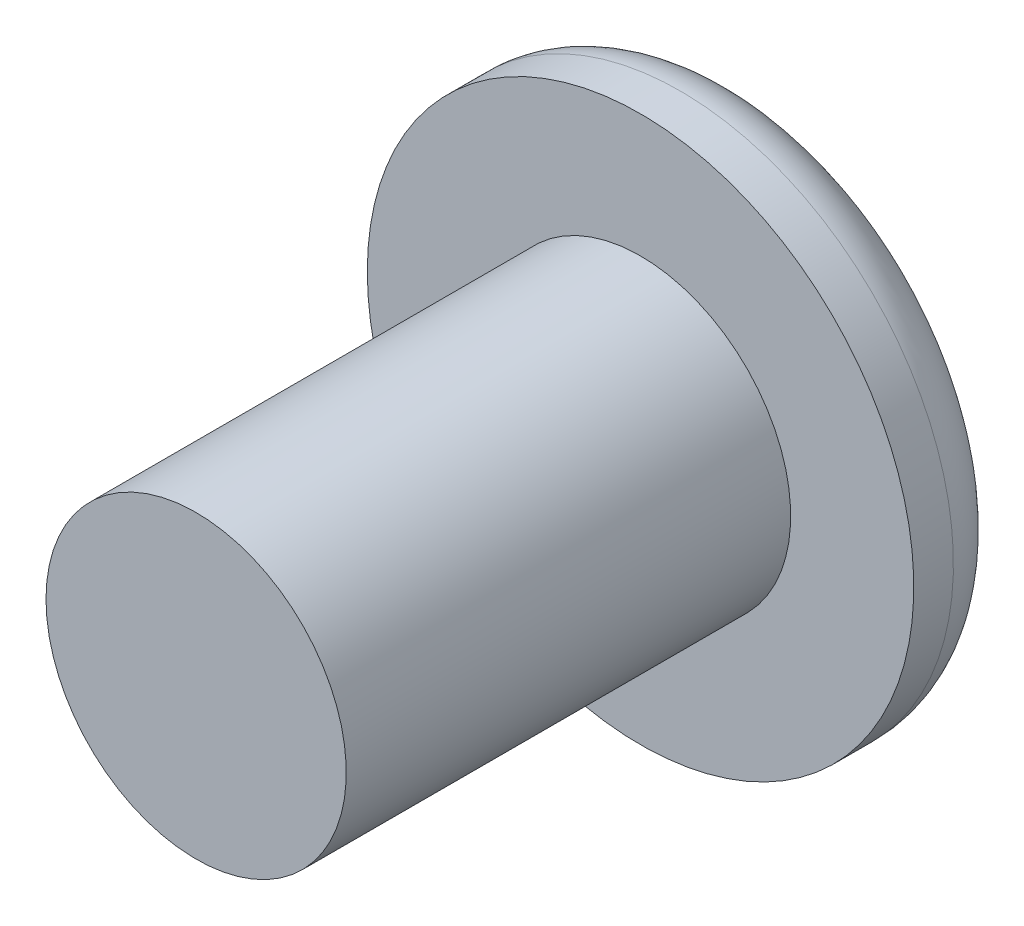
ISO-10303-21;
HEADER;
FILE_DESCRIPTION(('STEP AP214'),'2;1');
FILE_NAME('part.step','',(''),(''),'','','');
FILE_SCHEMA(('AUTOMOTIVE_DESIGN { 1 0 10303 214 1 1 1 1 }'));
ENDSEC;
DATA;
#1=APPLICATION_CONTEXT('core data for automotive mechanical design processes');
#2=APPLICATION_PROTOCOL_DEFINITION('international standard','automotive_design',2000,#1);
#3=PRODUCT_CONTEXT('',#1,'mechanical');
#4=PRODUCT('Part','Part','',(#3));
#5=PRODUCT_RELATED_PRODUCT_CATEGORY('part','',(#4));
#6=PRODUCT_DEFINITION_FORMATION('','',#4);
#7=PRODUCT_DEFINITION_CONTEXT('part definition',#1,'design');
#8=PRODUCT_DEFINITION('design','',#6,#7);
#9=PRODUCT_DEFINITION_SHAPE('','',#8);
#10=(LENGTH_UNIT() NAMED_UNIT(*) SI_UNIT(.MILLI.,.METRE.));
#11=(NAMED_UNIT(*) PLANE_ANGLE_UNIT() SI_UNIT($,.RADIAN.));
#12=(NAMED_UNIT(*) SI_UNIT($,.STERADIAN.) SOLID_ANGLE_UNIT());
#13=UNCERTAINTY_MEASURE_WITH_UNIT(LENGTH_MEASURE(1.E-05),#10,'distance_accuracy_value','');
#14=(GEOMETRIC_REPRESENTATION_CONTEXT(3) GLOBAL_UNCERTAINTY_ASSIGNED_CONTEXT((#13)) GLOBAL_UNIT_ASSIGNED_CONTEXT((#10,
#11,#12)) REPRESENTATION_CONTEXT('',''));
#15=CARTESIAN_POINT('',(0.,0.,0.));
#16=DIRECTION('',(0.,0.,1.));
#17=DIRECTION('',(1.,0.,0.));
#18=AXIS2_PLACEMENT_3D('',#15,#16,#17);
#19=CARTESIAN_POINT('',(-1.,-1.594453362781,-4.53));
#20=DIRECTION('',(-0.984807753012213,0.,0.173648177666902));
#21=DIRECTION('',(0.,1.,0.));
#22=AXIS2_PLACEMENT_3D('',#19,#20,#21);
#23=PLANE('',#22);
#24=DIRECTION('',(0.171087869746004,0.171087869746004,0.970287525247825));
#25=VECTOR('',#24,1.);
#26=CARTESIAN_POINT('',(-1.,-0.3030384493976,-4.53));
#27=LINE('',#26,#25);
#28=CARTESIAN_POINT('',(-1.,-0.3030384493976,-4.53));
#29=VERTEX_POINT('',#28);
#30=CARTESIAN_POINT('',(-0.8589384154332,-0.1619768648308,-3.73));
#31=VERTEX_POINT('',#30);
#32=EDGE_CURVE('E11',#29,#31,#27,.T.);
#33=ORIENTED_EDGE('',*,*,#32,.F.);
#34=DIRECTION('',(0.,1.,0.));
#35=VECTOR('',#34,1.);
#36=CARTESIAN_POINT('',(-1.,-0.3030384493976,-4.53));
#37=LINE('',#36,#35);
#38=CARTESIAN_POINT('',(-1.,0.3030384493976,-4.53));
#39=VERTEX_POINT('',#38);
#40=EDGE_CURVE('E304',#29,#39,#37,.T.);
#41=ORIENTED_EDGE('',*,*,#40,.T.);
#42=DIRECTION('',(0.171087869746004,-0.171087869746004,0.970287525247825));
#43=VECTOR('',#42,1.);
#44=CARTESIAN_POINT('',(-1.,0.3030384493976,-4.53));
#45=LINE('',#44,#43);
#46=CARTESIAN_POINT('',(-0.8589384154332,0.1619768648308,-3.73));
#47=VERTEX_POINT('',#46);
#48=EDGE_CURVE('E404',#39,#47,#45,.T.);
#49=ORIENTED_EDGE('',*,*,#48,.T.);
#50=DIRECTION('',(0.,1.,0.));
#51=VECTOR('',#50,1.);
#52=CARTESIAN_POINT('',(-0.8589384154332,-0.1619768648308,-3.73));
#53=LINE('',#52,#51);
#54=EDGE_CURVE('E263',#31,#47,#53,.T.);
#55=ORIENTED_EDGE('',*,*,#54,.F.);
#56=EDGE_LOOP('',(#33,#41,#49,#55));
#57=FACE_BOUND('',#56,.T.);
#58=ADVANCED_FACE('F16',(#57),#23,.F.);
#59=CARTESIAN_POINT('',(-1.838179807416,-1.338179807416,-10.435308));
#60=DIRECTION('',(0.171087869746005,0.171087869746004,0.970287525247825));
#61=DIRECTION('',(-0.984807753012214,0.,0.173648177666898));
#62=AXIS2_PLACEMENT_3D('',#59,#60,#61);
#63=CYLINDRICAL_SURFACE('',#62,0.2);
#64=CARTESIAN_POINT('',(-0.655853093055913,-0.155853093055913,-3.73));
#65=DIRECTION('',(0.,0.,-1.));
#66=DIRECTION('',(-0.707106781186547,-0.707106781186548,0.));
#67=AXIS2_PLACEMENT_3D('',#64,#65,#66);
#68=ELLIPSE('',#67,0.206124468052825,0.2);
#69=CARTESIAN_POINT('',(-0.6619768648308,-0.3589384154332,-3.73));
#70=VERTEX_POINT('',#69);
#71=EDGE_CURVE('E364',#70,#31,#68,.T.);
#72=ORIENTED_EDGE('',*,*,#71,.F.);
#73=DIRECTION('',(0.171087869746004,0.171087869746004,0.970287525247825));
#74=VECTOR('',#73,1.);
#75=CARTESIAN_POINT('',(-0.8030384493976,-0.5,-4.53));
#76=LINE('',#75,#74);
#77=CARTESIAN_POINT('',(-0.8030384493976,-0.5,-4.53));
#78=VERTEX_POINT('',#77);
#79=EDGE_CURVE('E27',#78,#70,#76,.T.);
#80=ORIENTED_EDGE('',*,*,#79,.F.);
#81=CARTESIAN_POINT('',(-0.796914677622658,-0.296914677622658,-4.53));
#82=DIRECTION('',(0.,0.,1.));
#83=DIRECTION('',(-0.707106781186547,-0.707106781186548,0.));
#84=AXIS2_PLACEMENT_3D('',#81,#82,#83);
#85=ELLIPSE('',#84,0.206124468052825,0.2);
#86=EDGE_CURVE('E308',#29,#78,#85,.T.);
#87=ORIENTED_EDGE('',*,*,#86,.F.);
#88=ORIENTED_EDGE('',*,*,#32,.T.);
#89=EDGE_LOOP('',(#72,#80,#87,#88));
#90=FACE_BOUND('',#89,.T.);
#91=ADVANCED_FACE('F602',(#90),#63,.F.);
#92=CARTESIAN_POINT('',(0.5944533627813,-0.5,-4.53));
#93=DIRECTION('',(0.,-0.984807753012213,0.173648177666902));
#94=DIRECTION('',(-1.,0.,0.));
#95=AXIS2_PLACEMENT_3D('',#92,#93,#94);
#96=PLANE('',#95);
#97=DIRECTION('',(-0.171087869746004,-0.171087869746004,-0.970287525247825));
#98=VECTOR('',#97,1.);
#99=CARTESIAN_POINT('',(-0.5558999660357,-0.3589384154332,-3.73));
#100=LINE('',#99,#98);
#101=CARTESIAN_POINT('',(-0.5558999660357,-0.3589384154332,-3.73));
#102=VERTEX_POINT('',#101);
#103=CARTESIAN_POINT('',(-0.6969615506024,-0.5,-4.53));
#104=VERTEX_POINT('',#103);
#105=EDGE_CURVE('E357',#102,#104,#100,.T.);
#106=ORIENTED_EDGE('',*,*,#105,.T.);
#107=DIRECTION('',(-1.,0.,0.));
#108=VECTOR('',#107,1.);
#109=CARTESIAN_POINT('',(-0.6969615506024,-0.5,-4.53));
#110=LINE('',#109,#108);
#111=EDGE_CURVE('E316',#104,#78,#110,.T.);
#112=ORIENTED_EDGE('',*,*,#111,.T.);
#113=ORIENTED_EDGE('',*,*,#79,.T.);
#114=DIRECTION('',(-1.,0.,0.));
#115=VECTOR('',#114,1.);
#116=CARTESIAN_POINT('',(-0.5558999660357,-0.3589384154332,-3.73));
#117=LINE('',#116,#115);
#118=EDGE_CURVE('E393',#102,#70,#117,.T.);
#119=ORIENTED_EDGE('',*,*,#118,.F.);
#120=EDGE_LOOP('',(#106,#112,#113,#119));
#121=FACE_BOUND('',#120,.T.);
#122=ADVANCED_FACE('F608',(#121),#96,.F.);
#123=CARTESIAN_POINT('',(1.136941030026,1.136941030026,5.905308));
#124=DIRECTION('',(-0.171087869746004,-0.171087869746005,-0.970287525247825));
#125=DIRECTION('',(0.,0.984807753012214,-0.173648177666898));
#126=AXIS2_PLACEMENT_3D('',#123,#124,#125);
#127=CYLINDRICAL_SURFACE('',#126,0.2);
#128=CARTESIAN_POINT('',(-0.703085322376535,-0.703085322376535,-4.53));
#129=DIRECTION('',(0.,0.,-1.));
#130=DIRECTION('',(0.707106781186548,0.707106781186547,0.));
#131=AXIS2_PLACEMENT_3D('',#128,#129,#130);
#132=ELLIPSE('',#131,0.206124468052825,0.2);
#133=CARTESIAN_POINT('',(-0.5,-0.6969615506024,-4.53));
#134=VERTEX_POINT('',#133);
#135=EDGE_CURVE('E320',#104,#134,#132,.T.);
#136=ORIENTED_EDGE('',*,*,#135,.F.);
#137=ORIENTED_EDGE('',*,*,#105,.F.);
#138=CARTESIAN_POINT('',(-0.56202373780979,-0.56202373780979,-3.73));
#139=DIRECTION('',(0.,0.,1.));
#140=DIRECTION('',(0.707106781186548,0.707106781186547,0.));
#141=AXIS2_PLACEMENT_3D('',#138,#139,#140);
#142=ELLIPSE('',#141,0.206124468052825,0.2);
#143=CARTESIAN_POINT('',(-0.3589384154332,-0.5558999660357,-3.73));
#144=VERTEX_POINT('',#143);
#145=EDGE_CURVE('E377',#144,#102,#142,.T.);
#146=ORIENTED_EDGE('',*,*,#145,.F.);
#147=DIRECTION('',(-0.171087869746004,-0.171087869746004,-0.970287525247825));
#148=VECTOR('',#147,1.);
#149=CARTESIAN_POINT('',(-0.3589384154332,-0.5558999660357,-3.73));
#150=LINE('',#149,#148);
#151=EDGE_CURVE('E492',#144,#134,#150,.T.);
#152=ORIENTED_EDGE('',*,*,#151,.T.);
#153=EDGE_LOOP('',(#136,#137,#146,#152));
#154=FACE_BOUND('',#153,.T.);
#155=ADVANCED_FACE('F623',(#154),#127,.T.);
#156=CARTESIAN_POINT('',(-0.5,-2.094453362781,-4.53));
#157=DIRECTION('',(-0.984807753012213,0.,0.173648177666902));
#158=DIRECTION('',(0.,1.,0.));
#159=AXIS2_PLACEMENT_3D('',#156,#157,#158);
#160=PLANE('',#159);
#161=ORIENTED_EDGE('',*,*,#151,.F.);
#162=DIRECTION('',(0.,1.,0.));
#163=VECTOR('',#162,1.);
#164=CARTESIAN_POINT('',(-0.3589384154332,-0.6619768648308,-3.73));
#165=LINE('',#164,#163);
#166=CARTESIAN_POINT('',(-0.3589384154332,-0.6619768648308,-3.73));
#167=VERTEX_POINT('',#166);
#168=EDGE_CURVE('E373',#167,#144,#165,.T.);
#169=ORIENTED_EDGE('',*,*,#168,.F.);
#170=DIRECTION('',(0.171087869746004,0.171087869746004,0.970287525247825));
#171=VECTOR('',#170,1.);
#172=CARTESIAN_POINT('',(-0.5,-0.8030384493976,-4.53));
#173=LINE('',#172,#171);
#174=CARTESIAN_POINT('',(-0.5,-0.8030384493976,-4.53));
#175=VERTEX_POINT('',#174);
#176=EDGE_CURVE('E291',#175,#167,#173,.T.);
#177=ORIENTED_EDGE('',*,*,#176,.F.);
#178=DIRECTION('',(0.,1.,0.));
#179=VECTOR('',#178,1.);
#180=CARTESIAN_POINT('',(-0.5,-0.8030384493976,-4.53));
#181=LINE('',#180,#179);
#182=EDGE_CURVE('E296',#175,#134,#181,.T.);
#183=ORIENTED_EDGE('',*,*,#182,.T.);
#184=EDGE_LOOP('',(#161,#169,#177,#183));
#185=FACE_BOUND('',#184,.T.);
#186=ADVANCED_FACE('F619',(#185),#160,.F.);
#187=CARTESIAN_POINT('',(-1.338179807416,-1.838179807416,-10.435308));
#188=DIRECTION('',(0.171087869746005,0.171087869746004,0.970287525247825));
#189=DIRECTION('',(-0.984807753012214,0.,0.173648177666898));
#190=AXIS2_PLACEMENT_3D('',#187,#188,#189);
#191=CYLINDRICAL_SURFACE('',#190,0.2);
#192=CARTESIAN_POINT('',(-0.155853093055913,-0.655853093055913,-3.73));
#193=DIRECTION('',(0.,0.,-1.));
#194=DIRECTION('',(-0.707106781186547,-0.707106781186548,0.));
#195=AXIS2_PLACEMENT_3D('',#192,#193,#194);
#196=ELLIPSE('',#195,0.206124468052825,0.2);
#197=CARTESIAN_POINT('',(-0.1619768648308,-0.8589384154332,-3.73));
#198=VERTEX_POINT('',#197);
#199=EDGE_CURVE('E378',#198,#167,#196,.T.);
#200=ORIENTED_EDGE('',*,*,#199,.F.);
#201=DIRECTION('',(0.171087869746004,0.171087869746004,0.970287525247825));
#202=VECTOR('',#201,1.);
#203=CARTESIAN_POINT('',(-0.3030384493976,-1.,-4.53));
#204=LINE('',#203,#202);
#205=CARTESIAN_POINT('',(-0.3030384493976,-1.,-4.53));
#206=VERTEX_POINT('',#205);
#207=EDGE_CURVE('E460',#206,#198,#204,.T.);
#208=ORIENTED_EDGE('',*,*,#207,.F.);
#209=CARTESIAN_POINT('',(-0.296914677622658,-0.796914677622658,-4.53));
#210=DIRECTION('',(0.,0.,1.));
#211=DIRECTION('',(-0.707106781186547,-0.707106781186548,0.));
#212=AXIS2_PLACEMENT_3D('',#209,#210,#211);
#213=ELLIPSE('',#212,0.206124468052825,0.2);
#214=EDGE_CURVE('E293',#175,#206,#213,.T.);
#215=ORIENTED_EDGE('',*,*,#214,.F.);
#216=ORIENTED_EDGE('',*,*,#176,.T.);
#217=EDGE_LOOP('',(#200,#208,#215,#216));
#218=FACE_BOUND('',#217,.T.);
#219=ADVANCED_FACE('F622',(#218),#191,.F.);
#220=CARTESIAN_POINT('',(1.594453362781,-1.,-4.53));
#221=DIRECTION('',(0.,-0.984807753012213,0.173648177666902));
#222=DIRECTION('',(-1.,0.,0.));
#223=AXIS2_PLACEMENT_3D('',#220,#221,#222);
#224=PLANE('',#223);
#225=DIRECTION('',(-0.171087869746004,0.171087869746004,0.970287525247825));
#226=VECTOR('',#225,1.);
#227=CARTESIAN_POINT('',(0.3030384493976,-1.,-4.53));
#228=LINE('',#227,#226);
#229=CARTESIAN_POINT('',(0.3030384493976,-1.,-4.53));
#230=VERTEX_POINT('',#229);
#231=CARTESIAN_POINT('',(0.1619768648308,-0.8589384154332,-3.73));
#232=VERTEX_POINT('',#231);
#233=EDGE_CURVE('E459',#230,#232,#228,.T.);
#234=ORIENTED_EDGE('',*,*,#233,.F.);
#235=DIRECTION('',(-1.,0.,0.));
#236=VECTOR('',#235,1.);
#237=CARTESIAN_POINT('',(0.3030384493976,-1.,-4.53));
#238=LINE('',#237,#236);
#239=EDGE_CURVE('E295',#230,#206,#238,.T.);
#240=ORIENTED_EDGE('',*,*,#239,.T.);
#241=ORIENTED_EDGE('',*,*,#207,.T.);
#242=DIRECTION('',(-1.,0.,0.));
#243=VECTOR('',#242,1.);
#244=CARTESIAN_POINT('',(0.1619768648308,-0.8589384154332,-3.73));
#245=LINE('',#244,#243);
#246=EDGE_CURVE('E385',#232,#198,#245,.T.);
#247=ORIENTED_EDGE('',*,*,#246,.F.);
#248=EDGE_LOOP('',(#234,#240,#241,#247));
#249=FACE_BOUND('',#248,.T.);
#250=ADVANCED_FACE('F634',(#249),#224,.F.);
#251=CARTESIAN_POINT('',(1.338179807416,-1.838179807416,-10.435308));
#252=DIRECTION('',(-0.171087869746004,0.171087869746005,0.970287525247825));
#253=DIRECTION('',(0.,-0.984807753012214,0.173648177666898));
#254=AXIS2_PLACEMENT_3D('',#251,#252,#253);
#255=CYLINDRICAL_SURFACE('',#254,0.2);
#256=CARTESIAN_POINT('',(0.155853093055913,-0.655853093055913,-3.73));
#257=DIRECTION('',(0.,0.,-1.));
#258=DIRECTION('',(0.707106781186548,-0.707106781186547,0.));
#259=AXIS2_PLACEMENT_3D('',#256,#257,#258);
#260=ELLIPSE('',#259,0.206124468052825,0.2);
#261=CARTESIAN_POINT('',(0.3589384154332,-0.6619768648308,-3.73));
#262=VERTEX_POINT('',#261);
#263=EDGE_CURVE('E389',#262,#232,#260,.T.);
#264=ORIENTED_EDGE('',*,*,#263,.F.);
#265=DIRECTION('',(-0.171087869746004,0.171087869746004,0.970287525247825));
#266=VECTOR('',#265,1.);
#267=CARTESIAN_POINT('',(0.5,-0.8030384493976,-4.53));
#268=LINE('',#267,#266);
#269=CARTESIAN_POINT('',(0.5,-0.8030384493976,-4.53));
#270=VERTEX_POINT('',#269);
#271=EDGE_CURVE('E426',#270,#262,#268,.T.);
#272=ORIENTED_EDGE('',*,*,#271,.F.);
#273=CARTESIAN_POINT('',(0.296914677622658,-0.796914677622658,-4.53));
#274=DIRECTION('',(0.,0.,1.));
#275=DIRECTION('',(0.707106781186548,-0.707106781186547,0.));
#276=AXIS2_PLACEMENT_3D('',#273,#274,#275);
#277=ELLIPSE('',#276,0.206124468052825,0.2);
#278=EDGE_CURVE('E352',#230,#270,#277,.T.);
#279=ORIENTED_EDGE('',*,*,#278,.F.);
#280=ORIENTED_EDGE('',*,*,#233,.T.);
#281=EDGE_LOOP('',(#264,#272,#279,#280));
#282=FACE_BOUND('',#281,.T.);
#283=ADVANCED_FACE('F700',(#282),#255,.F.);
#284=CARTESIAN_POINT('',(0.5,0.5944533627813,-4.53));
#285=DIRECTION('',(0.984807753012213,0.,0.173648177666902));
#286=DIRECTION('',(0.,-1.,0.));
#287=AXIS2_PLACEMENT_3D('',#284,#285,#286);
#288=PLANE('',#287);
#289=DIRECTION('',(0.171087869746004,-0.171087869746004,-0.970287525247825));
#290=VECTOR('',#289,1.);
#291=CARTESIAN_POINT('',(0.3589384154332,-0.5558999660357,-3.73));
#292=LINE('',#291,#290);
#293=CARTESIAN_POINT('',(0.3589384154332,-0.5558999660357,-3.73));
#294=VERTEX_POINT('',#293);
#295=CARTESIAN_POINT('',(0.5,-0.6969615506024,-4.53));
#296=VERTEX_POINT('',#295);
#297=EDGE_CURVE('E422',#294,#296,#292,.T.);
#298=ORIENTED_EDGE('',*,*,#297,.T.);
#299=DIRECTION('',(0.,-1.,0.));
#300=VECTOR('',#299,1.);
#301=CARTESIAN_POINT('',(0.5,-0.6969615506024,-4.53));
#302=LINE('',#301,#300);
#303=EDGE_CURVE('E303',#296,#270,#302,.T.);
#304=ORIENTED_EDGE('',*,*,#303,.T.);
#305=ORIENTED_EDGE('',*,*,#271,.T.);
#306=DIRECTION('',(0.,-1.,0.));
#307=VECTOR('',#306,1.);
#308=CARTESIAN_POINT('',(0.3589384154332,-0.5558999660357,-3.73));
#309=LINE('',#308,#307);
#310=EDGE_CURVE('E383',#294,#262,#309,.T.);
#311=ORIENTED_EDGE('',*,*,#310,.F.);
#312=EDGE_LOOP('',(#298,#304,#305,#311));
#313=FACE_BOUND('',#312,.T.);
#314=ADVANCED_FACE('F555',(#313),#288,.F.);
#315=CARTESIAN_POINT('',(-1.136941030026,1.136941030026,5.905308));
#316=DIRECTION('',(0.171087869746005,-0.171087869746004,-0.970287525247825));
#317=DIRECTION('',(-0.984807753012214,0.,-0.173648177666898));
#318=AXIS2_PLACEMENT_3D('',#315,#316,#317);
#319=CYLINDRICAL_SURFACE('',#318,0.2);
#320=CARTESIAN_POINT('',(0.703085322376535,-0.703085322376535,-4.53));
#321=DIRECTION('',(0.,0.,-1.));
#322=DIRECTION('',(-0.707106781186547,0.707106781186548,0.));
#323=AXIS2_PLACEMENT_3D('',#320,#321,#322);
#324=ELLIPSE('',#323,0.206124468052825,0.2);
#325=CARTESIAN_POINT('',(0.6969615506024,-0.5,-4.53));
#326=VERTEX_POINT('',#325);
#327=EDGE_CURVE('E298',#296,#326,#324,.T.);
#328=ORIENTED_EDGE('',*,*,#327,.F.);
#329=ORIENTED_EDGE('',*,*,#297,.F.);
#330=CARTESIAN_POINT('',(0.56202373780979,-0.56202373780979,-3.73));
#331=DIRECTION('',(0.,0.,1.));
#332=DIRECTION('',(-0.707106781186547,0.707106781186548,0.));
#333=AXIS2_PLACEMENT_3D('',#330,#331,#332);
#334=ELLIPSE('',#333,0.206124468052825,0.2);
#335=CARTESIAN_POINT('',(0.5558999660357,-0.3589384154332,-3.73));
#336=VERTEX_POINT('',#335);
#337=EDGE_CURVE('E379',#336,#294,#334,.T.);
#338=ORIENTED_EDGE('',*,*,#337,.F.);
#339=DIRECTION('',(0.171087869746004,-0.171087869746004,-0.970287525247825));
#340=VECTOR('',#339,1.);
#341=CARTESIAN_POINT('',(0.5558999660357,-0.3589384154332,-3.73));
#342=LINE('',#341,#340);
#343=EDGE_CURVE('E344',#336,#326,#342,.T.);
#344=ORIENTED_EDGE('',*,*,#343,.T.);
#345=EDGE_LOOP('',(#328,#329,#338,#344));
#346=FACE_BOUND('',#345,.T.);
#347=ADVANCED_FACE('F540',(#346),#319,.T.);
#348=CARTESIAN_POINT('',(2.094453362781,-0.5,-4.53));
#349=DIRECTION('',(0.,-0.984807753012213,0.173648177666902));
#350=DIRECTION('',(-1.,0.,0.));
#351=AXIS2_PLACEMENT_3D('',#348,#349,#350);
#352=PLANE('',#351);
#353=ORIENTED_EDGE('',*,*,#343,.F.);
#354=DIRECTION('',(-1.,0.,0.));
#355=VECTOR('',#354,1.);
#356=CARTESIAN_POINT('',(0.6619768648308,-0.3589384154332,-3.73));
#357=LINE('',#356,#355);
#358=CARTESIAN_POINT('',(0.6619768648308,-0.3589384154332,-3.73));
#359=VERTEX_POINT('',#358);
#360=EDGE_CURVE('E384',#359,#336,#357,.T.);
#361=ORIENTED_EDGE('',*,*,#360,.F.);
#362=DIRECTION('',(-0.171087869746004,0.171087869746004,0.970287525247825));
#363=VECTOR('',#362,1.);
#364=CARTESIAN_POINT('',(0.8030384493976,-0.5,-4.53));
#365=LINE('',#364,#363);
#366=CARTESIAN_POINT('',(0.8030384493976,-0.5,-4.53));
#367=VERTEX_POINT('',#366);
#368=EDGE_CURVE('E341',#367,#359,#365,.T.);
#369=ORIENTED_EDGE('',*,*,#368,.F.);
#370=DIRECTION('',(-1.,0.,0.));
#371=VECTOR('',#370,1.);
#372=CARTESIAN_POINT('',(0.8030384493976,-0.5,-4.53));
#373=LINE('',#372,#371);
#374=EDGE_CURVE('E302',#367,#326,#373,.T.);
#375=ORIENTED_EDGE('',*,*,#374,.T.);
#376=EDGE_LOOP('',(#353,#361,#369,#375));
#377=FACE_BOUND('',#376,.T.);
#378=ADVANCED_FACE('F545',(#377),#352,.F.);
#379=CARTESIAN_POINT('',(1.838179807416,-1.338179807416,-10.435308));
#380=DIRECTION('',(-0.171087869746004,0.171087869746005,0.970287525247825));
#381=DIRECTION('',(0.,-0.984807753012214,0.173648177666898));
#382=AXIS2_PLACEMENT_3D('',#379,#380,#381);
#383=CYLINDRICAL_SURFACE('',#382,0.2);
#384=CARTESIAN_POINT('',(0.655853093055913,-0.155853093055913,-3.73));
#385=DIRECTION('',(0.,0.,-1.));
#386=DIRECTION('',(0.707106781186548,-0.707106781186547,0.));
#387=AXIS2_PLACEMENT_3D('',#384,#385,#386);
#388=ELLIPSE('',#387,0.206124468052825,0.2);
#389=CARTESIAN_POINT('',(0.8589384154332,-0.1619768648308,-3.73));
#390=VERTEX_POINT('',#389);
#391=EDGE_CURVE('E417',#390,#359,#388,.T.);
#392=ORIENTED_EDGE('',*,*,#391,.F.);
#393=DIRECTION('',(-0.171087869746004,0.171087869746004,0.970287525247825));
#394=VECTOR('',#393,1.);
#395=CARTESIAN_POINT('',(1.,-0.3030384493976,-4.53));
#396=LINE('',#395,#394);
#397=CARTESIAN_POINT('',(1.,-0.3030384493976,-4.53));
#398=VERTEX_POINT('',#397);
#399=EDGE_CURVE('E240',#398,#390,#396,.T.);
#400=ORIENTED_EDGE('',*,*,#399,.F.);
#401=CARTESIAN_POINT('',(0.796914677622658,-0.296914677622658,-4.53));
#402=DIRECTION('',(0.,0.,1.));
#403=DIRECTION('',(0.707106781186548,-0.707106781186547,0.));
#404=AXIS2_PLACEMENT_3D('',#401,#402,#403);
#405=ELLIPSE('',#404,0.206124468052825,0.2);
#406=EDGE_CURVE('E325',#367,#398,#405,.T.);
#407=ORIENTED_EDGE('',*,*,#406,.F.);
#408=ORIENTED_EDGE('',*,*,#368,.T.);
#409=EDGE_LOOP('',(#392,#400,#407,#408));
#410=FACE_BOUND('',#409,.T.);
#411=ADVANCED_FACE('F558',(#410),#383,.F.);
#412=CARTESIAN_POINT('',(1.,1.594453362781,-4.53));
#413=DIRECTION('',(0.984807753012213,0.,0.173648177666902));
#414=DIRECTION('',(0.,-1.,0.));
#415=AXIS2_PLACEMENT_3D('',#412,#413,#414);
#416=PLANE('',#415);
#417=DIRECTION('',(-0.171087869746004,-0.171087869746004,0.970287525247825));
#418=VECTOR('',#417,1.);
#419=CARTESIAN_POINT('',(1.,0.3030384493976,-4.53));
#420=LINE('',#419,#418);
#421=CARTESIAN_POINT('',(1.,0.3030384493976,-4.53));
#422=VERTEX_POINT('',#421);
#423=CARTESIAN_POINT('',(0.8589384154332,0.1619768648308,-3.73));
#424=VERTEX_POINT('',#423);
#425=EDGE_CURVE('E229',#422,#424,#420,.T.);
#426=ORIENTED_EDGE('',*,*,#425,.F.);
#427=DIRECTION('',(0.,-1.,0.));
#428=VECTOR('',#427,1.);
#429=CARTESIAN_POINT('',(1.,0.3030384493976,-4.53));
#430=LINE('',#429,#428);
#431=EDGE_CURVE('E321',#422,#398,#430,.T.);
#432=ORIENTED_EDGE('',*,*,#431,.T.);
#433=ORIENTED_EDGE('',*,*,#399,.T.);
#434=DIRECTION('',(0.,-1.,0.));
#435=VECTOR('',#434,1.);
#436=CARTESIAN_POINT('',(0.8589384154332,0.1619768648308,-3.73));
#437=LINE('',#436,#435);
#438=EDGE_CURVE('E421',#424,#390,#437,.T.);
#439=ORIENTED_EDGE('',*,*,#438,.F.);
#440=EDGE_LOOP('',(#426,#432,#433,#439));
#441=FACE_BOUND('',#440,.T.);
#442=ADVANCED_FACE('F763',(#441),#416,.F.);
#443=CARTESIAN_POINT('',(1.838179807416,1.338179807416,-10.435308));
#444=DIRECTION('',(-0.171087869746005,-0.171087869746004,0.970287525247825));
#445=DIRECTION('',(0.984807753012214,0.,0.173648177666898));
#446=AXIS2_PLACEMENT_3D('',#443,#444,#445);
#447=CYLINDRICAL_SURFACE('',#446,0.2);
#448=CARTESIAN_POINT('',(0.655853093055913,0.155853093055913,-3.73));
#449=DIRECTION('',(0.,0.,-1.));
#450=DIRECTION('',(0.707106781186547,0.707106781186548,0.));
#451=AXIS2_PLACEMENT_3D('',#448,#449,#450);
#452=ELLIPSE('',#451,0.206124468052825,0.2);
#453=CARTESIAN_POINT('',(0.6619768648308,0.3589384154332,-3.73));
#454=VERTEX_POINT('',#453);
#455=EDGE_CURVE('E403',#454,#424,#452,.T.);
#456=ORIENTED_EDGE('',*,*,#455,.F.);
#457=DIRECTION('',(-0.171087869746004,-0.171087869746004,0.970287525247825));
#458=VECTOR('',#457,1.);
#459=CARTESIAN_POINT('',(0.8030384493976,0.5,-4.53));
#460=LINE('',#459,#458);
#461=CARTESIAN_POINT('',(0.8030384493976,0.5,-4.53));
#462=VERTEX_POINT('',#461);
#463=EDGE_CURVE('E399',#462,#454,#460,.T.);
#464=ORIENTED_EDGE('',*,*,#463,.F.);
#465=CARTESIAN_POINT('',(0.796914677622658,0.296914677622658,-4.53));
#466=DIRECTION('',(0.,0.,1.));
#467=DIRECTION('',(0.707106781186547,0.707106781186548,0.));
#468=AXIS2_PLACEMENT_3D('',#465,#466,#467);
#469=ELLIPSE('',#468,0.206124468052825,0.2);
#470=EDGE_CURVE('E324',#422,#462,#469,.T.);
#471=ORIENTED_EDGE('',*,*,#470,.F.);
#472=ORIENTED_EDGE('',*,*,#425,.T.);
#473=EDGE_LOOP('',(#456,#464,#471,#472));
#474=FACE_BOUND('',#473,.T.);
#475=ADVANCED_FACE('F725',(#474),#447,.F.);
#476=CARTESIAN_POINT('',(-0.5,-0.5944533627813,-4.53));
#477=DIRECTION('',(-0.984807753012213,0.,0.173648177666902));
#478=DIRECTION('',(0.,1.,0.));
#479=AXIS2_PLACEMENT_3D('',#476,#477,#478);
#480=PLANE('',#479);
#481=DIRECTION('',(-0.171087869746004,0.171087869746004,-0.970287525247825));
#482=VECTOR('',#481,1.);
#483=CARTESIAN_POINT('',(-0.3589384154332,0.5558999660357,-3.73));
#484=LINE('',#483,#482);
#485=CARTESIAN_POINT('',(-0.3589384154332,0.5558999660357,-3.73));
#486=VERTEX_POINT('',#485);
#487=CARTESIAN_POINT('',(-0.5,0.6969615506024,-4.53));
#488=VERTEX_POINT('',#487);
#489=EDGE_CURVE('E255',#486,#488,#484,.T.);
#490=ORIENTED_EDGE('',*,*,#489,.T.);
#491=DIRECTION('',(0.,1.,0.));
#492=VECTOR('',#491,1.);
#493=CARTESIAN_POINT('',(-0.5,0.6969615506024,-4.53));
#494=LINE('',#493,#492);
#495=CARTESIAN_POINT('',(-0.5,0.8030384493976,-4.53));
#496=VERTEX_POINT('',#495);
#497=EDGE_CURVE('E281',#488,#496,#494,.T.);
#498=ORIENTED_EDGE('',*,*,#497,.T.);
#499=DIRECTION('',(0.171087869746004,-0.171087869746004,0.970287525247825));
#500=VECTOR('',#499,1.);
#501=CARTESIAN_POINT('',(-0.5,0.8030384493976,-4.53));
#502=LINE('',#501,#500);
#503=CARTESIAN_POINT('',(-0.3589384154332,0.6619768648308,-3.73));
#504=VERTEX_POINT('',#503);
#505=EDGE_CURVE('E257',#496,#504,#502,.T.);
#506=ORIENTED_EDGE('',*,*,#505,.T.);
#507=DIRECTION('',(0.,1.,0.));
#508=VECTOR('',#507,1.);
#509=CARTESIAN_POINT('',(-0.3589384154332,0.5558999660357,-3.73));
#510=LINE('',#509,#508);
#511=EDGE_CURVE('E250',#486,#504,#510,.T.);
#512=ORIENTED_EDGE('',*,*,#511,.F.);
#513=EDGE_LOOP('',(#490,#498,#506,#512));
#514=FACE_BOUND('',#513,.T.);
#515=ADVANCED_FACE('F252',(#514),#480,.F.);
#516=CARTESIAN_POINT('',(-1.338179807416,1.838179807416,-10.435308));
#517=DIRECTION('',(0.171087869746004,-0.171087869746005,0.970287525247825));
#518=DIRECTION('',(0.,0.984807753012214,0.173648177666898));
#519=AXIS2_PLACEMENT_3D('',#516,#517,#518);
#520=CYLINDRICAL_SURFACE('',#519,0.2);
#521=CARTESIAN_POINT('',(-0.155853093055913,0.655853093055913,-3.73));
#522=DIRECTION('',(0.,0.,-1.));
#523=DIRECTION('',(-0.707106781186548,0.707106781186547,0.));
#524=AXIS2_PLACEMENT_3D('',#521,#522,#523);
#525=ELLIPSE('',#524,0.206124468052825,0.2);
#526=CARTESIAN_POINT('',(-0.1619768648308,0.8589384154332,-3.73));
#527=VERTEX_POINT('',#526);
#528=EDGE_CURVE('E262',#504,#527,#525,.T.);
#529=ORIENTED_EDGE('',*,*,#528,.F.);
#530=ORIENTED_EDGE('',*,*,#505,.F.);
#531=CARTESIAN_POINT('',(-0.296914677622658,0.796914677622658,-4.53));
#532=DIRECTION('',(0.,0.,1.));
#533=DIRECTION('',(-0.707106781186548,0.707106781186547,0.));
#534=AXIS2_PLACEMENT_3D('',#531,#532,#533);
#535=ELLIPSE('',#534,0.206124468052825,0.2);
#536=CARTESIAN_POINT('',(-0.3030384493976,1.,-4.53));
#537=VERTEX_POINT('',#536);
#538=EDGE_CURVE('E287',#537,#496,#535,.T.);
#539=ORIENTED_EDGE('',*,*,#538,.F.);
#540=DIRECTION('',(0.171087869746004,-0.171087869746004,0.970287525247825));
#541=VECTOR('',#540,1.);
#542=CARTESIAN_POINT('',(-0.3030384493976,1.,-4.53));
#543=LINE('',#542,#541);
#544=EDGE_CURVE('E446',#537,#527,#543,.T.);
#545=ORIENTED_EDGE('',*,*,#544,.T.);
#546=EDGE_LOOP('',(#529,#530,#539,#545));
#547=FACE_BOUND('',#546,.T.);
#548=ADVANCED_FACE('F613',(#547),#520,.F.);
#549=CARTESIAN_POINT('',(-1.594453362781,1.,-4.53));
#550=DIRECTION('',(0.,0.984807753012213,0.173648177666902));
#551=DIRECTION('',(1.,0.,0.));
#552=AXIS2_PLACEMENT_3D('',#549,#550,#551);
#553=PLANE('',#552);
#554=ORIENTED_EDGE('',*,*,#544,.F.);
#555=DIRECTION('',(1.,0.,0.));
#556=VECTOR('',#555,1.);
#557=CARTESIAN_POINT('',(-0.3030384493976,1.,-4.53));
#558=LINE('',#557,#556);
#559=CARTESIAN_POINT('',(0.3030384493976,1.,-4.53));
#560=VERTEX_POINT('',#559);
#561=EDGE_CURVE('E415',#537,#560,#558,.T.);
#562=ORIENTED_EDGE('',*,*,#561,.T.);
#563=DIRECTION('',(-0.171087869746004,-0.171087869746004,0.970287525247825));
#564=VECTOR('',#563,1.);
#565=CARTESIAN_POINT('',(0.3030384493976,1.,-4.53));
#566=LINE('',#565,#564);
#567=CARTESIAN_POINT('',(0.1619768648308,0.8589384154332,-3.73));
#568=VERTEX_POINT('',#567);
#569=EDGE_CURVE('E336',#560,#568,#566,.T.);
#570=ORIENTED_EDGE('',*,*,#569,.T.);
#571=DIRECTION('',(1.,0.,0.));
#572=VECTOR('',#571,1.);
#573=CARTESIAN_POINT('',(-0.1619768648308,0.8589384154332,-3.73));
#574=LINE('',#573,#572);
#575=EDGE_CURVE('E445',#527,#568,#574,.T.);
#576=ORIENTED_EDGE('',*,*,#575,.F.);
#577=EDGE_LOOP('',(#554,#562,#570,#576));
#578=FACE_BOUND('',#577,.T.);
#579=ADVANCED_FACE('F18',(#578),#553,.F.);
#580=CARTESIAN_POINT('',(1.338179807416,1.838179807416,-10.435308));
#581=DIRECTION('',(-0.171087869746005,-0.171087869746004,0.970287525247825));
#582=DIRECTION('',(0.984807753012214,0.,0.173648177666898));
#583=AXIS2_PLACEMENT_3D('',#580,#581,#582);
#584=CYLINDRICAL_SURFACE('',#583,0.2);
#585=CARTESIAN_POINT('',(0.155853093055913,0.655853093055913,-3.73));
#586=DIRECTION('',(0.,0.,-1.));
#587=DIRECTION('',(0.707106781186547,0.707106781186548,0.));
#588=AXIS2_PLACEMENT_3D('',#585,#586,#587);
#589=ELLIPSE('',#588,0.206124468052825,0.2);
#590=CARTESIAN_POINT('',(0.3589384154332,0.6619768648308,-3.73));
#591=VERTEX_POINT('',#590);
#592=EDGE_CURVE('E315',#568,#591,#589,.T.);
#593=ORIENTED_EDGE('',*,*,#592,.F.);
#594=ORIENTED_EDGE('',*,*,#569,.F.);
#595=CARTESIAN_POINT('',(0.296914677622658,0.796914677622658,-4.53));
#596=DIRECTION('',(0.,0.,1.));
#597=DIRECTION('',(0.707106781186547,0.707106781186548,0.));
#598=AXIS2_PLACEMENT_3D('',#595,#596,#597);
#599=ELLIPSE('',#598,0.206124468052825,0.2);
#600=CARTESIAN_POINT('',(0.5,0.8030384493976,-4.53));
#601=VERTEX_POINT('',#600);
#602=EDGE_CURVE('E411',#601,#560,#599,.T.);
#603=ORIENTED_EDGE('',*,*,#602,.F.);
#604=DIRECTION('',(-0.171087869746004,-0.171087869746004,0.970287525247825));
#605=VECTOR('',#604,1.);
#606=CARTESIAN_POINT('',(0.5,0.8030384493976,-4.53));
#607=LINE('',#606,#605);
#608=EDGE_CURVE('E333',#601,#591,#607,.T.);
#609=ORIENTED_EDGE('',*,*,#608,.T.);
#610=EDGE_LOOP('',(#593,#594,#603,#609));
#611=FACE_BOUND('',#610,.T.);
#612=ADVANCED_FACE('F625',(#611),#584,.F.);
#613=CARTESIAN_POINT('',(0.5,2.094453362781,-4.53));
#614=DIRECTION('',(0.984807753012213,0.,0.173648177666902));
#615=DIRECTION('',(0.,-1.,0.));
#616=AXIS2_PLACEMENT_3D('',#613,#614,#615);
#617=PLANE('',#616);
#618=DIRECTION('',(0.171087869746004,0.171087869746004,-0.970287525247825));
#619=VECTOR('',#618,1.);
#620=CARTESIAN_POINT('',(0.3589384154332,0.5558999660357,-3.73));
#621=LINE('',#620,#619);
#622=CARTESIAN_POINT('',(0.3589384154332,0.5558999660357,-3.73));
#623=VERTEX_POINT('',#622);
#624=CARTESIAN_POINT('',(0.5,0.6969615506024,-4.53));
#625=VERTEX_POINT('',#624);
#626=EDGE_CURVE('E41',#623,#625,#621,.T.);
#627=ORIENTED_EDGE('',*,*,#626,.F.);
#628=DIRECTION('',(0.,-1.,0.));
#629=VECTOR('',#628,1.);
#630=CARTESIAN_POINT('',(0.3589384154332,0.6619768648308,-3.73));
#631=LINE('',#630,#629);
#632=EDGE_CURVE('E310',#591,#623,#631,.T.);
#633=ORIENTED_EDGE('',*,*,#632,.F.);
#634=ORIENTED_EDGE('',*,*,#608,.F.);
#635=DIRECTION('',(0.,-1.,0.));
#636=VECTOR('',#635,1.);
#637=CARTESIAN_POINT('',(0.5,0.8030384493976,-4.53));
#638=LINE('',#637,#636);
#639=EDGE_CURVE('E416',#601,#625,#638,.T.);
#640=ORIENTED_EDGE('',*,*,#639,.T.);
#641=EDGE_LOOP('',(#627,#633,#634,#640));
#642=FACE_BOUND('',#641,.T.);
#643=ADVANCED_FACE('F628',(#642),#617,.F.);
#644=CARTESIAN_POINT('',(-1.136941030026,-1.136941030026,5.905308));
#645=DIRECTION('',(0.171087869746004,0.171087869746005,-0.970287525247825));
#646=DIRECTION('',(0.,-0.984807753012214,-0.173648177666898));
#647=AXIS2_PLACEMENT_3D('',#644,#645,#646);
#648=CYLINDRICAL_SURFACE('',#647,0.2);
#649=CARTESIAN_POINT('',(0.703085322376535,0.703085322376535,-4.53));
#650=DIRECTION('',(0.,0.,-1.));
#651=DIRECTION('',(-0.707106781186548,-0.707106781186547,0.));
#652=AXIS2_PLACEMENT_3D('',#649,#650,#651);
#653=ELLIPSE('',#652,0.206124468052825,0.2);
#654=CARTESIAN_POINT('',(0.6969615506024,0.5,-4.53));
#655=VERTEX_POINT('',#654);
#656=EDGE_CURVE('E500',#655,#625,#653,.T.);
#657=ORIENTED_EDGE('',*,*,#656,.F.);
#658=DIRECTION('',(0.171087869746004,0.171087869746004,-0.970287525247825));
#659=VECTOR('',#658,1.);
#660=CARTESIAN_POINT('',(0.5558999660357,0.3589384154332,-3.73));
#661=LINE('',#660,#659);
#662=CARTESIAN_POINT('',(0.5558999660357,0.3589384154332,-3.73));
#663=VERTEX_POINT('',#662);
#664=EDGE_CURVE('E332',#663,#655,#661,.T.);
#665=ORIENTED_EDGE('',*,*,#664,.F.);
#666=CARTESIAN_POINT('',(0.56202373780979,0.56202373780979,-3.73));
#667=DIRECTION('',(0.,0.,1.));
#668=DIRECTION('',(-0.707106781186548,-0.707106781186547,0.));
#669=AXIS2_PLACEMENT_3D('',#666,#667,#668);
#670=ELLIPSE('',#669,0.206124468052825,0.2);
#671=EDGE_CURVE('E314',#623,#663,#670,.T.);
#672=ORIENTED_EDGE('',*,*,#671,.F.);
#673=ORIENTED_EDGE('',*,*,#626,.T.);
#674=EDGE_LOOP('',(#657,#665,#672,#673));
#675=FACE_BOUND('',#674,.T.);
#676=ADVANCED_FACE('F642',(#675),#648,.T.);
#677=CARTESIAN_POINT('',(-0.5944533627813,0.5,-4.53));
#678=DIRECTION('',(0.,0.984807753012213,0.173648177666902));
#679=DIRECTION('',(1.,0.,0.));
#680=AXIS2_PLACEMENT_3D('',#677,#678,#679);
#681=PLANE('',#680);
#682=ORIENTED_EDGE('',*,*,#664,.T.);
#683=DIRECTION('',(1.,0.,0.));
#684=VECTOR('',#683,1.);
#685=CARTESIAN_POINT('',(0.6969615506024,0.5,-4.53));
#686=LINE('',#685,#684);
#687=EDGE_CURVE('E20',#655,#462,#686,.T.);
#688=ORIENTED_EDGE('',*,*,#687,.T.);
#689=ORIENTED_EDGE('',*,*,#463,.T.);
#690=DIRECTION('',(1.,0.,0.));
#691=VECTOR('',#690,1.);
#692=CARTESIAN_POINT('',(0.5558999660357,0.3589384154332,-3.73));
#693=LINE('',#692,#691);
#694=EDGE_CURVE('E400',#663,#454,#693,.T.);
#695=ORIENTED_EDGE('',*,*,#694,.F.);
#696=EDGE_LOOP('',(#682,#688,#689,#695));
#697=FACE_BOUND('',#696,.T.);
#698=ADVANCED_FACE('F640',(#697),#681,.F.);
#699=CARTESIAN_POINT('',(0.,0.,-3.73));
#700=DIRECTION('',(0.,0.,-1.));
#701=DIRECTION('',(0.,-1.,0.));
#702=AXIS2_PLACEMENT_3D('',#699,#700,#701);
#703=PLANE('',#702);
#704=ORIENTED_EDGE('',*,*,#694,.T.);
#705=ORIENTED_EDGE('',*,*,#455,.T.);
#706=ORIENTED_EDGE('',*,*,#438,.T.);
#707=ORIENTED_EDGE('',*,*,#391,.T.);
#708=ORIENTED_EDGE('',*,*,#360,.T.);
#709=ORIENTED_EDGE('',*,*,#337,.T.);
#710=ORIENTED_EDGE('',*,*,#310,.T.);
#711=ORIENTED_EDGE('',*,*,#263,.T.);
#712=ORIENTED_EDGE('',*,*,#246,.T.);
#713=ORIENTED_EDGE('',*,*,#199,.T.);
#714=ORIENTED_EDGE('',*,*,#168,.T.);
#715=ORIENTED_EDGE('',*,*,#145,.T.);
#716=ORIENTED_EDGE('',*,*,#118,.T.);
#717=ORIENTED_EDGE('',*,*,#71,.T.);
#718=ORIENTED_EDGE('',*,*,#54,.T.);
#719=CARTESIAN_POINT('',(-0.655853093055913,0.155853093055913,-3.73));
#720=DIRECTION('',(0.,0.,-1.));
#721=DIRECTION('',(-0.707106781186548,0.707106781186547,0.));
#722=AXIS2_PLACEMENT_3D('',#719,#720,#721);
#723=ELLIPSE('',#722,0.206124468052825,0.2);
#724=CARTESIAN_POINT('',(-0.6619768648308,0.3589384154332,-3.73));
#725=VERTEX_POINT('',#724);
#726=EDGE_CURVE('E340',#47,#725,#723,.T.);
#727=ORIENTED_EDGE('',*,*,#726,.T.);
#728=DIRECTION('',(1.,0.,0.));
#729=VECTOR('',#728,1.);
#730=CARTESIAN_POINT('',(-0.6619768648308,0.3589384154332,-3.73));
#731=LINE('',#730,#729);
#732=CARTESIAN_POINT('',(-0.5558999660357,0.3589384154332,-3.73));
#733=VERTEX_POINT('',#732);
#734=EDGE_CURVE('E270',#725,#733,#731,.T.);
#735=ORIENTED_EDGE('',*,*,#734,.T.);
#736=CARTESIAN_POINT('',(-0.56202373780979,0.56202373780979,-3.73));
#737=DIRECTION('',(0.,0.,1.));
#738=DIRECTION('',(0.707106781186547,-0.707106781186548,0.));
#739=AXIS2_PLACEMENT_3D('',#736,#737,#738);
#740=ELLIPSE('',#739,0.206124468052825,0.2);
#741=EDGE_CURVE('E266',#733,#486,#740,.T.);
#742=ORIENTED_EDGE('',*,*,#741,.T.);
#743=ORIENTED_EDGE('',*,*,#511,.T.);
#744=ORIENTED_EDGE('',*,*,#528,.T.);
#745=ORIENTED_EDGE('',*,*,#575,.T.);
#746=ORIENTED_EDGE('',*,*,#592,.T.);
#747=ORIENTED_EDGE('',*,*,#632,.T.);
#748=ORIENTED_EDGE('',*,*,#671,.T.);
#749=EDGE_LOOP('',(#704,#705,#706,#707,#708,#709,#710,#711,#712,#713,#714,#715,#716,#717,#718,
#727,#735,#742,#743,#744,#745,#746,#747,#748));
#750=FACE_BOUND('',#749,.T.);
#751=ADVANCED_FACE('F268',(#750),#703,.T.);
#752=CARTESIAN_POINT('',(-1.838179807416,1.338179807416,-10.435308));
#753=DIRECTION('',(0.171087869746004,-0.171087869746005,0.970287525247825));
#754=DIRECTION('',(0.,0.984807753012214,0.173648177666898));
#755=AXIS2_PLACEMENT_3D('',#752,#753,#754);
#756=CYLINDRICAL_SURFACE('',#755,0.2);
#757=ORIENTED_EDGE('',*,*,#726,.F.);
#758=ORIENTED_EDGE('',*,*,#48,.F.);
#759=CARTESIAN_POINT('',(-0.796914677622658,0.296914677622658,-4.53));
#760=DIRECTION('',(0.,0.,1.));
#761=DIRECTION('',(-0.707106781186548,0.707106781186547,0.));
#762=AXIS2_PLACEMENT_3D('',#759,#760,#761);
#763=ELLIPSE('',#762,0.206124468052825,0.2);
#764=CARTESIAN_POINT('',(-0.8030384493976,0.5,-4.53));
#765=VERTEX_POINT('',#764);
#766=EDGE_CURVE('E309',#765,#39,#763,.T.);
#767=ORIENTED_EDGE('',*,*,#766,.F.);
#768=DIRECTION('',(0.171087869746004,-0.171087869746004,0.970287525247825));
#769=VECTOR('',#768,1.);
#770=CARTESIAN_POINT('',(-0.8030384493976,0.5,-4.53));
#771=LINE('',#770,#769);
#772=EDGE_CURVE('E328',#765,#725,#771,.T.);
#773=ORIENTED_EDGE('',*,*,#772,.T.);
#774=EDGE_LOOP('',(#757,#758,#767,#773));
#775=FACE_BOUND('',#774,.T.);
#776=ADVANCED_FACE('F648',(#775),#756,.F.);
#777=CARTESIAN_POINT('',(-2.094453362781,0.5,-4.53));
#778=DIRECTION('',(0.,0.984807753012213,0.173648177666902));
#779=DIRECTION('',(1.,0.,0.));
#780=AXIS2_PLACEMENT_3D('',#777,#778,#779);
#781=PLANE('',#780);
#782=DIRECTION('',(-0.171087869746004,0.171087869746004,-0.970287525247825));
#783=VECTOR('',#782,1.);
#784=CARTESIAN_POINT('',(-0.5558999660357,0.3589384154332,-3.73));
#785=LINE('',#784,#783);
#786=CARTESIAN_POINT('',(-0.6969615506024,0.5,-4.53));
#787=VERTEX_POINT('',#786);
#788=EDGE_CURVE('E274',#733,#787,#785,.T.);
#789=ORIENTED_EDGE('',*,*,#788,.F.);
#790=ORIENTED_EDGE('',*,*,#734,.F.);
#791=ORIENTED_EDGE('',*,*,#772,.F.);
#792=DIRECTION('',(1.,0.,0.));
#793=VECTOR('',#792,1.);
#794=CARTESIAN_POINT('',(-0.8030384493976,0.5,-4.53));
#795=LINE('',#794,#793);
#796=EDGE_CURVE('E348',#765,#787,#795,.T.);
#797=ORIENTED_EDGE('',*,*,#796,.T.);
#798=EDGE_LOOP('',(#789,#790,#791,#797));
#799=FACE_BOUND('',#798,.T.);
#800=ADVANCED_FACE('F597',(#799),#781,.F.);
#801=CARTESIAN_POINT('',(1.136941030026,-1.136941030026,5.905308));
#802=DIRECTION('',(-0.171087869746005,0.171087869746004,-0.970287525247825));
#803=DIRECTION('',(0.984807753012214,0.,-0.173648177666898));
#804=AXIS2_PLACEMENT_3D('',#801,#802,#803);
#805=CYLINDRICAL_SURFACE('',#804,0.2);
#806=CARTESIAN_POINT('',(-0.703085322376535,0.703085322376535,-4.53));
#807=DIRECTION('',(0.,0.,-1.));
#808=DIRECTION('',(0.707106781186547,-0.707106781186548,0.));
#809=AXIS2_PLACEMENT_3D('',#806,#807,#808);
#810=ELLIPSE('',#809,0.206124468052825,0.2);
#811=EDGE_CURVE('E279',#488,#787,#810,.T.);
#812=ORIENTED_EDGE('',*,*,#811,.F.);
#813=ORIENTED_EDGE('',*,*,#489,.F.);
#814=ORIENTED_EDGE('',*,*,#741,.F.);
#815=ORIENTED_EDGE('',*,*,#788,.T.);
#816=EDGE_LOOP('',(#812,#813,#814,#815));
#817=FACE_BOUND('',#816,.T.);
#818=ADVANCED_FACE('F277',(#817),#805,.T.);
#819=CARTESIAN_POINT('',(0.,0.,-4.53));
#820=DIRECTION('',(0.,0.,-1.));
#821=DIRECTION('',(0.,-1.,0.));
#822=AXIS2_PLACEMENT_3D('',#819,#820,#821);
#823=PLANE('',#822);
#824=ORIENTED_EDGE('',*,*,#811,.T.);
#825=ORIENTED_EDGE('',*,*,#796,.F.);
#826=ORIENTED_EDGE('',*,*,#766,.T.);
#827=ORIENTED_EDGE('',*,*,#40,.F.);
#828=ORIENTED_EDGE('',*,*,#86,.T.);
#829=ORIENTED_EDGE('',*,*,#111,.F.);
#830=ORIENTED_EDGE('',*,*,#135,.T.);
#831=ORIENTED_EDGE('',*,*,#182,.F.);
#832=ORIENTED_EDGE('',*,*,#214,.T.);
#833=ORIENTED_EDGE('',*,*,#239,.F.);
#834=ORIENTED_EDGE('',*,*,#278,.T.);
#835=ORIENTED_EDGE('',*,*,#303,.F.);
#836=ORIENTED_EDGE('',*,*,#327,.T.);
#837=ORIENTED_EDGE('',*,*,#374,.F.);
#838=ORIENTED_EDGE('',*,*,#406,.T.);
#839=ORIENTED_EDGE('',*,*,#431,.F.);
#840=ORIENTED_EDGE('',*,*,#470,.T.);
#841=ORIENTED_EDGE('',*,*,#687,.F.);
#842=ORIENTED_EDGE('',*,*,#656,.T.);
#843=ORIENTED_EDGE('',*,*,#639,.F.);
#844=ORIENTED_EDGE('',*,*,#602,.T.);
#845=ORIENTED_EDGE('',*,*,#561,.F.);
#846=ORIENTED_EDGE('',*,*,#538,.T.);
#847=ORIENTED_EDGE('',*,*,#497,.F.);
#848=EDGE_LOOP('',(#824,#825,#826,#827,#828,#829,#830,#831,#832,#833,#834,#835,#836,#837,#838,
#839,#840,#841,#842,#843,#844,#845,#846,#847));
#849=FACE_BOUND('',#848,.T.);
#850=CARTESIAN_POINT('',(0.,0.,-4.53));
#851=DIRECTION('',(0.,0.,-1.));
#852=DIRECTION('',(1.,0.,0.));
#853=AXIS2_PLACEMENT_3D('',#850,#851,#852);
#854=CIRCLE('',#853,1.775);
#855=CARTESIAN_POINT('',(-1.775,0.,-4.53));
#856=VERTEX_POINT('',#855);
#857=CARTESIAN_POINT('',(-1.77497488263483,-0.00944277583452771,-4.53));
#858=VERTEX_POINT('',#857);
#859=EDGE_CURVE('E369',#856,#858,#854,.T.);
#860=ORIENTED_EDGE('',*,*,#859,.T.);
#861=CARTESIAN_POINT('',(0.,0.,-4.53));
#862=DIRECTION('',(0.,0.,-1.));
#863=DIRECTION('',(1.,0.,0.));
#864=AXIS2_PLACEMENT_3D('',#861,#862,#863);
#865=CIRCLE('',#864,1.775);
#866=EDGE_CURVE('E365',#858,#856,#865,.T.);
#867=ORIENTED_EDGE('',*,*,#866,.T.);
#868=EDGE_LOOP('',(#860,#867));
#869=FACE_BOUND('',#868,.T.);
#870=ADVANCED_FACE('F548',(#849,#869),#823,.T.);
#871=CARTESIAN_POINT('',(0.,0.,-4.03));
#872=DIRECTION('',(0.,0.,-1.));
#873=DIRECTION('',(0.999985849371737,0.0053198737095932,0.));
#874=AXIS2_PLACEMENT_3D('',#871,#872,#873);
#875=TOROIDAL_SURFACE('',#874,1.775,0.5);
#876=ORIENTED_EDGE('',*,*,#859,.F.);
#877=ORIENTED_EDGE('',*,*,#866,.F.);
#878=CARTESIAN_POINT('',(-1.77497488263483,-0.00944277583452771,-4.03));
#879=DIRECTION('',(-0.00531987370959307,0.999985849371737,0.));
#880=DIRECTION('',(-0.999985849371737,-0.00531987370959307,0.));
#881=AXIS2_PLACEMENT_3D('',#878,#879,#880);
#882=CIRCLE('',#881,0.5);
#883=CARTESIAN_POINT('',(-2.2749678073207,-0.0121027126893242,-4.03));
#884=VERTEX_POINT('',#883);
#885=EDGE_CURVE('E368',#858,#884,#882,.T.);
#886=ORIENTED_EDGE('',*,*,#885,.T.);
#887=CARTESIAN_POINT('',(0.,0.,-4.03));
#888=DIRECTION('',(0.,0.,-1.));
#889=DIRECTION('',(1.,0.,0.));
#890=AXIS2_PLACEMENT_3D('',#887,#888,#889);
#891=CIRCLE('',#890,2.275);
#892=CARTESIAN_POINT('',(-2.275,0.,-4.03));
#893=VERTEX_POINT('',#892);
#894=EDGE_CURVE('E452',#884,#893,#891,.T.);
#895=ORIENTED_EDGE('',*,*,#894,.T.);
#896=CARTESIAN_POINT('',(0.,0.,-4.03));
#897=DIRECTION('',(0.,0.,-1.));
#898=DIRECTION('',(1.,0.,0.));
#899=AXIS2_PLACEMENT_3D('',#896,#897,#898);
#900=CIRCLE('',#899,2.275);
#901=EDGE_CURVE('E408',#893,#884,#900,.T.);
#902=ORIENTED_EDGE('',*,*,#901,.T.);
#903=ORIENTED_EDGE('',*,*,#885,.F.);
#904=EDGE_LOOP('',(#876,#877,#886,#895,#902,#903));
#905=FACE_BOUND('',#904,.T.);
#906=ADVANCED_FACE('F587',(#905),#875,.T.);
#907=CARTESIAN_POINT('',(0.,0.,0.2265));
#908=DIRECTION('',(0.,0.,-1.));
#909=DIRECTION('',(1.,0.,0.));
#910=AXIS2_PLACEMENT_3D('',#907,#908,#909);
#911=CYLINDRICAL_SURFACE('',#910,2.275);
#912=ORIENTED_EDGE('',*,*,#901,.F.);
#913=DIRECTION('',(0.,0.,1.));
#914=VECTOR('',#913,1.);
#915=CARTESIAN_POINT('',(-2.275,0.,0.2265));
#916=LINE('',#915,#914);
#917=CARTESIAN_POINT('',(-2.275,0.,-3.7));
#918=VERTEX_POINT('',#917);
#919=EDGE_CURVE('E496',#893,#918,#916,.T.);
#920=ORIENTED_EDGE('',*,*,#919,.T.);
#921=CARTESIAN_POINT('',(0.,0.,-3.7));
#922=DIRECTION('',(0.,0.,-1.));
#923=DIRECTION('',(1.,0.,0.));
#924=AXIS2_PLACEMENT_3D('',#921,#922,#923);
#925=CIRCLE('',#924,2.275);
#926=EDGE_CURVE('E405',#918,#918,#925,.T.);
#927=ORIENTED_EDGE('',*,*,#926,.T.);
#928=ORIENTED_EDGE('',*,*,#919,.F.);
#929=ORIENTED_EDGE('',*,*,#894,.F.);
#930=EDGE_LOOP('',(#912,#920,#927,#928,#929));
#931=FACE_BOUND('',#930,.T.);
#932=ADVANCED_FACE('F580',(#931),#911,.T.);
#933=CARTESIAN_POINT('',(0.,0.,-3.7));
#934=DIRECTION('',(0.,0.,-1.));
#935=DIRECTION('',(0.,-1.,0.));
#936=AXIS2_PLACEMENT_3D('',#933,#934,#935);
#937=PLANE('',#936);
#938=CARTESIAN_POINT('',(0.,0.,-3.7));
#939=DIRECTION('',(0.,0.,1.));
#940=DIRECTION('',(1.,0.,0.));
#941=AXIS2_PLACEMENT_3D('',#938,#939,#940);
#942=CIRCLE('',#941,1.25);
#943=CARTESIAN_POINT('',(-1.25,0.,-3.7));
#944=VERTEX_POINT('',#943);
#945=EDGE_CURVE('E433',#944,#944,#942,.T.);
#946=ORIENTED_EDGE('',*,*,#945,.F.);
#947=EDGE_LOOP('',(#946));
#948=FACE_BOUND('',#947,.T.);
#949=ORIENTED_EDGE('',*,*,#926,.F.);
#950=EDGE_LOOP('',(#949));
#951=FACE_BOUND('',#950,.T.);
#952=ADVANCED_FACE('F636',(#948,#951),#937,.F.);
#953=CARTESIAN_POINT('',(0.,0.,0.2265));
#954=DIRECTION('',(0.,0.,-1.));
#955=DIRECTION('',(1.,0.,0.));
#956=AXIS2_PLACEMENT_3D('',#953,#954,#955);
#957=CYLINDRICAL_SURFACE('',#956,1.25);
#958=ORIENTED_EDGE('',*,*,#945,.T.);
#959=DIRECTION('',(0.,0.,1.));
#960=VECTOR('',#959,1.);
#961=CARTESIAN_POINT('',(-1.25,0.,0.2265));
#962=LINE('',#961,#960);
#963=CARTESIAN_POINT('',(-1.25,0.,0.));
#964=VERTEX_POINT('',#963);
#965=EDGE_CURVE('E409',#944,#964,#962,.T.);
#966=ORIENTED_EDGE('',*,*,#965,.T.);
#967=CARTESIAN_POINT('',(0.,0.,0.));
#968=DIRECTION('',(0.,0.,1.));
#969=DIRECTION('',(1.,0.,0.));
#970=AXIS2_PLACEMENT_3D('',#967,#968,#969);
#971=CIRCLE('',#970,1.25);
#972=EDGE_CURVE('E429',#964,#964,#971,.T.);
#973=ORIENTED_EDGE('',*,*,#972,.F.);
#974=ORIENTED_EDGE('',*,*,#965,.F.);
#975=EDGE_LOOP('',(#958,#966,#973,#974));
#976=FACE_BOUND('',#975,.T.);
#977=ADVANCED_FACE('F638',(#976),#957,.T.);
#978=CARTESIAN_POINT('',(0.,0.,0.));
#979=DIRECTION('',(0.,0.,-1.));
#980=DIRECTION('',(0.,-1.,0.));
#981=AXIS2_PLACEMENT_3D('',#978,#979,#980);
#982=PLANE('',#981);
#983=ORIENTED_EDGE('',*,*,#972,.T.);
#984=EDGE_LOOP('',(#983));
#985=FACE_BOUND('',#984,.T.);
#986=ADVANCED_FACE('F736',(#985),#982,.F.);
#987=CLOSED_SHELL('',(#58,#91,#122,#155,#186,#219,#250,#283,#314,#347,#378,#411,#442,#475,#515,
#548,#579,#612,#643,#676,#698,#751,#776,#800,#818,#870,#906,#932,#952,#977,#986));
#988=MANIFOLD_SOLID_BREP('B1',#987);
#989=ADVANCED_BREP_SHAPE_REPRESENTATION('',(#18,#988),#14);
#990=SHAPE_DEFINITION_REPRESENTATION(#9,#989);
ENDSEC;
END-ISO-10303-21;
